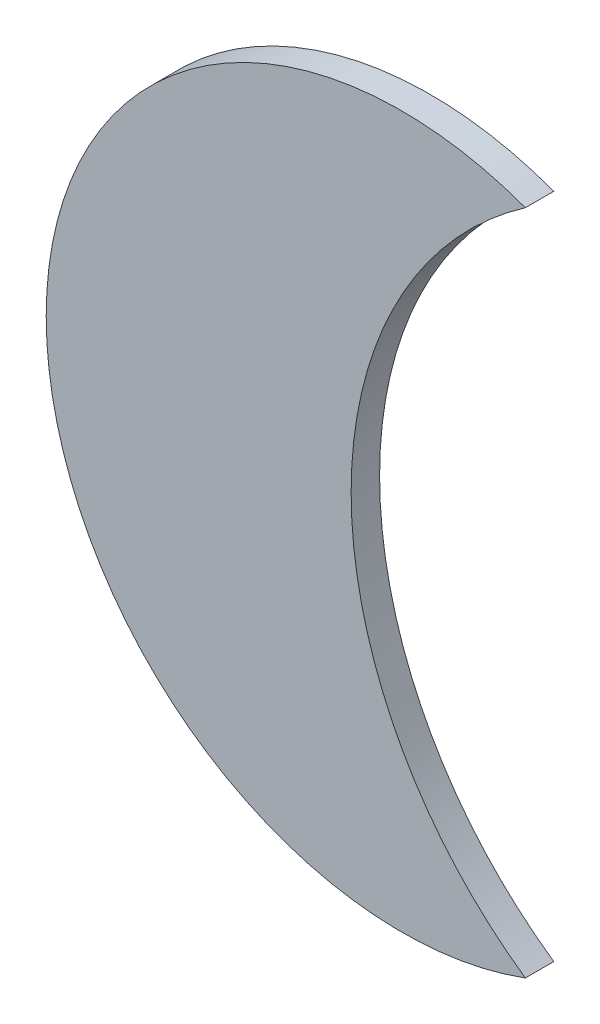
ISO-10303-21;
HEADER;
FILE_DESCRIPTION(('STEP AP214'),'2;1');
FILE_NAME('part.step','',(''),(''),'','','');
FILE_SCHEMA(('AUTOMOTIVE_DESIGN { 1 0 10303 214 1 1 1 1 }'));
ENDSEC;
DATA;
#1=APPLICATION_CONTEXT('core data for automotive mechanical design processes');
#2=APPLICATION_PROTOCOL_DEFINITION('international standard','automotive_design',2000,#1);
#3=PRODUCT_CONTEXT('',#1,'mechanical');
#4=PRODUCT('Part','Part','',(#3));
#5=PRODUCT_RELATED_PRODUCT_CATEGORY('part','',(#4));
#6=PRODUCT_DEFINITION_FORMATION('','',#4);
#7=PRODUCT_DEFINITION_CONTEXT('part definition',#1,'design');
#8=PRODUCT_DEFINITION('design','',#6,#7);
#9=PRODUCT_DEFINITION_SHAPE('','',#8);
#10=(LENGTH_UNIT() NAMED_UNIT(*) SI_UNIT(.MILLI.,.METRE.));
#11=(NAMED_UNIT(*) PLANE_ANGLE_UNIT() SI_UNIT($,.RADIAN.));
#12=(NAMED_UNIT(*) SI_UNIT($,.STERADIAN.) SOLID_ANGLE_UNIT());
#13=UNCERTAINTY_MEASURE_WITH_UNIT(LENGTH_MEASURE(1.E-05),#10,'distance_accuracy_value','');
#14=(GEOMETRIC_REPRESENTATION_CONTEXT(3) GLOBAL_UNCERTAINTY_ASSIGNED_CONTEXT((#13)) GLOBAL_UNIT_ASSIGNED_CONTEXT((#10,
#11,#12)) REPRESENTATION_CONTEXT('',''));
#15=CARTESIAN_POINT('',(0.,0.,0.));
#16=DIRECTION('',(0.,0.,1.));
#17=DIRECTION('',(1.,0.,0.));
#18=AXIS2_PLACEMENT_3D('',#15,#16,#17);
#19=CARTESIAN_POINT('',(0.,0.,20.));
#20=DIRECTION('',(0.,0.,-1.));
#21=DIRECTION('',(-1.,0.,0.));
#22=AXIS2_PLACEMENT_3D('',#19,#20,#21);
#23=CYLINDRICAL_SURFACE('',#22,250.);
#24=CARTESIAN_POINT('',(0.,0.,0.));
#25=DIRECTION('',(0.,0.,1.));
#26=DIRECTION('',(1.,0.,0.));
#27=AXIS2_PLACEMENT_3D('',#24,#25,#26);
#28=CIRCLE('',#27,250.);
#29=CARTESIAN_POINT('',(86.7971476716274,234.448832703577,0.));
#30=VERTEX_POINT('',#29);
#31=CARTESIAN_POINT('',(86.7971476716272,-234.448832703577,0.));
#32=VERTEX_POINT('',#31);
#33=EDGE_CURVE('E59',#30,#32,#28,.T.);
#34=ORIENTED_EDGE('',*,*,#33,.T.);
#35=DIRECTION('',(0.,0.,-1.));
#36=VECTOR('',#35,1.);
#37=CARTESIAN_POINT('',(86.7971476716272,-234.448832703577,20.));
#38=LINE('',#37,#36);
#39=CARTESIAN_POINT('',(86.7971476716272,-234.448832703577,20.));
#40=VERTEX_POINT('',#39);
#41=EDGE_CURVE('E11',#40,#32,#38,.T.);
#42=ORIENTED_EDGE('',*,*,#41,.F.);
#43=CARTESIAN_POINT('',(0.,0.,20.));
#44=DIRECTION('',(0.,0.,1.));
#45=DIRECTION('',(1.,0.,0.));
#46=AXIS2_PLACEMENT_3D('',#43,#44,#45);
#47=CIRCLE('',#46,250.);
#48=CARTESIAN_POINT('',(86.7971476716274,234.448832703577,20.));
#49=VERTEX_POINT('',#48);
#50=EDGE_CURVE('E61',#49,#40,#47,.T.);
#51=ORIENTED_EDGE('',*,*,#50,.F.);
#52=DIRECTION('',(0.,0.,-1.));
#53=VECTOR('',#52,1.);
#54=CARTESIAN_POINT('',(86.7971476716274,234.448832703577,20.));
#55=LINE('',#54,#53);
#56=EDGE_CURVE('E43',#49,#30,#55,.T.);
#57=ORIENTED_EDGE('',*,*,#56,.T.);
#58=EDGE_LOOP('',(#34,#42,#51,#57));
#59=FACE_BOUND('',#58,.T.);
#60=ADVANCED_FACE('F35',(#59),#23,.T.);
#61=CARTESIAN_POINT('',(250.,0.,20.));
#62=DIRECTION('',(0.,0.,-1.));
#63=DIRECTION('',(-1.,0.,0.));
#64=AXIS2_PLACEMENT_3D('',#61,#62,#63);
#65=CYLINDRICAL_SURFACE('',#64,285.65963341744);
#66=CARTESIAN_POINT('',(250.,0.,0.));
#67=DIRECTION('',(0.,0.,1.));
#68=DIRECTION('',(1.,0.,0.));
#69=AXIS2_PLACEMENT_3D('',#66,#67,#68);
#70=CIRCLE('',#69,285.65963341744);
#71=EDGE_CURVE('E66',#30,#32,#70,.T.);
#72=ORIENTED_EDGE('',*,*,#71,.F.);
#73=ORIENTED_EDGE('',*,*,#56,.F.);
#74=CARTESIAN_POINT('',(250.,0.,20.));
#75=DIRECTION('',(0.,0.,1.));
#76=DIRECTION('',(1.,0.,0.));
#77=AXIS2_PLACEMENT_3D('',#74,#75,#76);
#78=CIRCLE('',#77,285.65963341744);
#79=EDGE_CURVE('E63',#49,#40,#78,.T.);
#80=ORIENTED_EDGE('',*,*,#79,.T.);
#81=ORIENTED_EDGE('',*,*,#41,.T.);
#82=EDGE_LOOP('',(#72,#73,#80,#81));
#83=FACE_BOUND('',#82,.T.);
#84=ADVANCED_FACE('F68',(#83),#65,.F.);
#85=CARTESIAN_POINT('',(125.,0.,20.));
#86=DIRECTION('',(0.,0.,1.));
#87=DIRECTION('',(1.,0.,0.));
#88=AXIS2_PLACEMENT_3D('',#85,#86,#87);
#89=PLANE('',#88);
#90=ORIENTED_EDGE('',*,*,#50,.T.);
#91=ORIENTED_EDGE('',*,*,#79,.F.);
#92=EDGE_LOOP('',(#90,#91));
#93=FACE_BOUND('',#92,.T.);
#94=ADVANCED_FACE('F73',(#93),#89,.T.);
#95=CARTESIAN_POINT('',(125.,0.,0.));
#96=DIRECTION('',(0.,0.,1.));
#97=DIRECTION('',(1.,0.,0.));
#98=AXIS2_PLACEMENT_3D('',#95,#96,#97);
#99=PLANE('',#98);
#100=ORIENTED_EDGE('',*,*,#33,.F.);
#101=ORIENTED_EDGE('',*,*,#71,.T.);
#102=EDGE_LOOP('',(#100,#101));
#103=FACE_BOUND('',#102,.T.);
#104=ADVANCED_FACE('F65',(#103),#99,.F.);
#105=CLOSED_SHELL('',(#60,#84,#94,#104));
#106=MANIFOLD_SOLID_BREP('B2',#105);
#107=ADVANCED_BREP_SHAPE_REPRESENTATION('',(#18,#106),#14);
#108=SHAPE_DEFINITION_REPRESENTATION(#9,#107);
ENDSEC;
END-ISO-10303-21;
